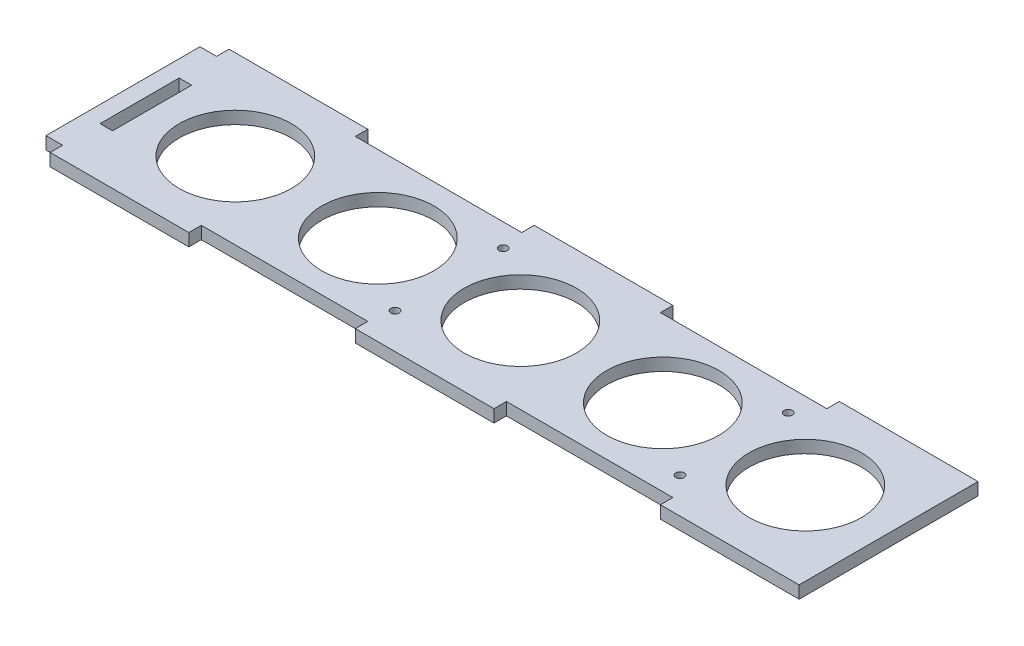
ISO-10303-21;
HEADER;
FILE_DESCRIPTION(('STEP AP214'),'2;1');
FILE_NAME('part.step','',(''),(''),'','','');
FILE_SCHEMA(('AUTOMOTIVE_DESIGN { 1 0 10303 214 1 1 1 1 }'));
ENDSEC;
DATA;
#1=APPLICATION_CONTEXT('core data for automotive mechanical design processes');
#2=APPLICATION_PROTOCOL_DEFINITION('international standard','automotive_design',2000,#1);
#3=PRODUCT_CONTEXT('',#1,'mechanical');
#4=PRODUCT('Part','Part','',(#3));
#5=PRODUCT_RELATED_PRODUCT_CATEGORY('part','',(#4));
#6=PRODUCT_DEFINITION_FORMATION('','',#4);
#7=PRODUCT_DEFINITION_CONTEXT('part definition',#1,'design');
#8=PRODUCT_DEFINITION('design','',#6,#7);
#9=PRODUCT_DEFINITION_SHAPE('','',#8);
#10=(LENGTH_UNIT() NAMED_UNIT(*) SI_UNIT(.MILLI.,.METRE.));
#11=(NAMED_UNIT(*) PLANE_ANGLE_UNIT() SI_UNIT($,.RADIAN.));
#12=(NAMED_UNIT(*) SI_UNIT($,.STERADIAN.) SOLID_ANGLE_UNIT());
#13=UNCERTAINTY_MEASURE_WITH_UNIT(LENGTH_MEASURE(1.E-05),#10,'distance_accuracy_value','');
#14=(GEOMETRIC_REPRESENTATION_CONTEXT(3) GLOBAL_UNCERTAINTY_ASSIGNED_CONTEXT((#13)) GLOBAL_UNIT_ASSIGNED_CONTEXT((#10,
#11,#12)) REPRESENTATION_CONTEXT('',''));
#15=CARTESIAN_POINT('',(0.,0.,0.));
#16=DIRECTION('',(0.,0.,1.));
#17=DIRECTION('',(1.,0.,0.));
#18=AXIS2_PLACEMENT_3D('',#15,#16,#17);
#19=CARTESIAN_POINT('',(74.375,3.,13.));
#20=DIRECTION('',(0.,-1.,0.));
#21=DIRECTION('',(0.,0.,-1.));
#22=AXIS2_PLACEMENT_3D('',#19,#20,#21);
#23=CYLINDRICAL_SURFACE('',#22,0.999999999999998);
#24=CARTESIAN_POINT('',(74.375,3.,13.));
#25=DIRECTION('',(0.,1.,0.));
#26=DIRECTION('',(0.,0.,1.));
#27=AXIS2_PLACEMENT_3D('',#24,#25,#26);
#28=CIRCLE('',#27,0.999999999999998);
#29=CARTESIAN_POINT('',(74.375,3.,14.));
#30=VERTEX_POINT('',#29);
#31=EDGE_CURVE('E387',#30,#30,#28,.F.);
#32=ORIENTED_EDGE('',*,*,#31,.F.);
#33=EDGE_LOOP('',(#32));
#34=FACE_BOUND('',#33,.T.);
#35=CARTESIAN_POINT('',(74.375,0.,13.));
#36=DIRECTION('',(0.,1.,0.));
#37=DIRECTION('',(0.,0.,1.));
#38=AXIS2_PLACEMENT_3D('',#35,#36,#37);
#39=CIRCLE('',#38,0.999999999999998);
#40=CARTESIAN_POINT('',(74.375,0.,14.));
#41=VERTEX_POINT('',#40);
#42=EDGE_CURVE('E260',#41,#41,#39,.F.);
#43=ORIENTED_EDGE('',*,*,#42,.T.);
#44=EDGE_LOOP('',(#43));
#45=FACE_BOUND('',#44,.T.);
#46=ADVANCED_FACE('F41',(#34,#45),#23,.F.);
#47=CARTESIAN_POINT('',(33.3333333333333,3.,0.));
#48=DIRECTION('',(-1.,0.,0.));
#49=DIRECTION('',(0.,0.,1.));
#50=AXIS2_PLACEMENT_3D('',#47,#48,#49);
#51=PLANE('',#50);
#52=DIRECTION('',(0.,0.,-1.));
#53=VECTOR('',#52,1.);
#54=CARTESIAN_POINT('',(33.3333333333333,0.,0.));
#55=LINE('',#54,#53);
#56=CARTESIAN_POINT('',(33.3333333333333,0.,21.5));
#57=VERTEX_POINT('',#56);
#58=CARTESIAN_POINT('',(33.3333333333333,0.,18.5));
#59=VERTEX_POINT('',#58);
#60=EDGE_CURVE('E174',#57,#59,#55,.T.);
#61=ORIENTED_EDGE('',*,*,#60,.T.);
#62=DIRECTION('',(0.,-1.,0.));
#63=VECTOR('',#62,1.);
#64=CARTESIAN_POINT('',(33.3333333333333,3.,18.5));
#65=LINE('',#64,#63);
#66=CARTESIAN_POINT('',(33.3333333333333,3.,18.5));
#67=VERTEX_POINT('',#66);
#68=EDGE_CURVE('E477',#67,#59,#65,.T.);
#69=ORIENTED_EDGE('',*,*,#68,.F.);
#70=DIRECTION('',(0.,0.,-1.));
#71=VECTOR('',#70,1.);
#72=CARTESIAN_POINT('',(33.3333333333333,3.,0.));
#73=LINE('',#72,#71);
#74=CARTESIAN_POINT('',(33.3333333333333,3.,21.5));
#75=VERTEX_POINT('',#74);
#76=EDGE_CURVE('E299',#75,#67,#73,.T.);
#77=ORIENTED_EDGE('',*,*,#76,.F.);
#78=DIRECTION('',(0.,-1.,0.));
#79=VECTOR('',#78,1.);
#80=CARTESIAN_POINT('',(33.3333333333333,3.,21.5));
#81=LINE('',#80,#79);
#82=EDGE_CURVE('E481',#75,#57,#81,.T.);
#83=ORIENTED_EDGE('',*,*,#82,.T.);
#84=EDGE_LOOP('',(#61,#69,#77,#83));
#85=FACE_BOUND('',#84,.T.);
#86=ADVANCED_FACE('F609',(#85),#51,.F.);
#87=CARTESIAN_POINT('',(0.,3.,18.5));
#88=DIRECTION('',(0.,0.,-1.));
#89=DIRECTION('',(-1.,0.,0.));
#90=AXIS2_PLACEMENT_3D('',#87,#88,#89);
#91=PLANE('',#90);
#92=DIRECTION('',(1.,0.,0.));
#93=VECTOR('',#92,1.);
#94=CARTESIAN_POINT('',(0.,0.,18.5));
#95=LINE('',#94,#93);
#96=CARTESIAN_POINT('',(73.3333333333333,0.,18.5));
#97=VERTEX_POINT('',#96);
#98=EDGE_CURVE('E180',#59,#97,#95,.T.);
#99=ORIENTED_EDGE('',*,*,#98,.T.);
#100=DIRECTION('',(0.,-1.,0.));
#101=VECTOR('',#100,1.);
#102=CARTESIAN_POINT('',(73.3333333333333,3.,18.5));
#103=LINE('',#102,#101);
#104=CARTESIAN_POINT('',(73.3333333333333,3.,18.5));
#105=VERTEX_POINT('',#104);
#106=EDGE_CURVE('E473',#105,#97,#103,.T.);
#107=ORIENTED_EDGE('',*,*,#106,.F.);
#108=DIRECTION('',(1.,0.,0.));
#109=VECTOR('',#108,1.);
#110=CARTESIAN_POINT('',(0.,3.,18.5));
#111=LINE('',#110,#109);
#112=EDGE_CURVE('E305',#67,#105,#111,.T.);
#113=ORIENTED_EDGE('',*,*,#112,.F.);
#114=ORIENTED_EDGE('',*,*,#68,.T.);
#115=EDGE_LOOP('',(#99,#107,#113,#114));
#116=FACE_BOUND('',#115,.T.);
#117=ADVANCED_FACE('F688',(#116),#91,.F.);
#118=CARTESIAN_POINT('',(73.3333333333333,3.,0.));
#119=DIRECTION('',(-1.,0.,0.));
#120=DIRECTION('',(0.,0.,1.));
#121=AXIS2_PLACEMENT_3D('',#118,#119,#120);
#122=PLANE('',#121);
#123=DIRECTION('',(0.,0.,-1.));
#124=VECTOR('',#123,1.);
#125=CARTESIAN_POINT('',(73.3333333333333,0.,0.));
#126=LINE('',#125,#124);
#127=CARTESIAN_POINT('',(73.3333333333333,0.,21.5));
#128=VERTEX_POINT('',#127);
#129=EDGE_CURVE('E184',#128,#97,#126,.T.);
#130=ORIENTED_EDGE('',*,*,#129,.F.);
#131=DIRECTION('',(0.,-1.,0.));
#132=VECTOR('',#131,1.);
#133=CARTESIAN_POINT('',(73.3333333333333,3.,21.5));
#134=LINE('',#133,#132);
#135=CARTESIAN_POINT('',(73.3333333333333,3.,21.5));
#136=VERTEX_POINT('',#135);
#137=EDGE_CURVE('E469',#136,#128,#134,.T.);
#138=ORIENTED_EDGE('',*,*,#137,.F.);
#139=DIRECTION('',(0.,0.,-1.));
#140=VECTOR('',#139,1.);
#141=CARTESIAN_POINT('',(73.3333333333333,3.,0.));
#142=LINE('',#141,#140);
#143=EDGE_CURVE('E309',#136,#105,#142,.T.);
#144=ORIENTED_EDGE('',*,*,#143,.T.);
#145=ORIENTED_EDGE('',*,*,#106,.T.);
#146=EDGE_LOOP('',(#130,#138,#144,#145));
#147=FACE_BOUND('',#146,.T.);
#148=ADVANCED_FACE('F685',(#147),#122,.T.);
#149=CARTESIAN_POINT('',(0.,3.,21.5));
#150=DIRECTION('',(0.,0.,-1.));
#151=DIRECTION('',(-1.,0.,0.));
#152=AXIS2_PLACEMENT_3D('',#149,#150,#151);
#153=PLANE('',#152);
#154=DIRECTION('',(1.,0.,0.));
#155=VECTOR('',#154,1.);
#156=CARTESIAN_POINT('',(0.,0.,21.5));
#157=LINE('',#156,#155);
#158=CARTESIAN_POINT('',(106.666666666667,0.,21.4999999999999));
#159=VERTEX_POINT('',#158);
#160=EDGE_CURVE('E177',#128,#159,#157,.T.);
#161=ORIENTED_EDGE('',*,*,#160,.T.);
#162=DIRECTION('',(0.,-1.,0.));
#163=VECTOR('',#162,1.);
#164=CARTESIAN_POINT('',(106.666666666667,3.,21.4999999999999));
#165=LINE('',#164,#163);
#166=CARTESIAN_POINT('',(106.666666666667,3.,21.4999999999999));
#167=VERTEX_POINT('',#166);
#168=EDGE_CURVE('E465',#167,#159,#165,.T.);
#169=ORIENTED_EDGE('',*,*,#168,.F.);
#170=DIRECTION('',(1.,0.,0.));
#171=VECTOR('',#170,1.);
#172=CARTESIAN_POINT('',(0.,3.,21.5));
#173=LINE('',#172,#171);
#174=EDGE_CURVE('E302',#136,#167,#173,.T.);
#175=ORIENTED_EDGE('',*,*,#174,.F.);
#176=ORIENTED_EDGE('',*,*,#137,.T.);
#177=EDGE_LOOP('',(#161,#169,#175,#176));
#178=FACE_BOUND('',#177,.T.);
#179=ADVANCED_FACE('F682',(#178),#153,.F.);
#180=CARTESIAN_POINT('',(106.666666666667,3.,0.));
#181=DIRECTION('',(-1.,0.,0.));
#182=DIRECTION('',(0.,0.,1.));
#183=AXIS2_PLACEMENT_3D('',#180,#181,#182);
#184=PLANE('',#183);
#185=DIRECTION('',(0.,0.,-1.));
#186=VECTOR('',#185,1.);
#187=CARTESIAN_POINT('',(106.666666666667,0.,0.));
#188=LINE('',#187,#186);
#189=CARTESIAN_POINT('',(106.666666666667,0.,18.5));
#190=VERTEX_POINT('',#189);
#191=EDGE_CURVE('E191',#159,#190,#188,.T.);
#192=ORIENTED_EDGE('',*,*,#191,.T.);
#193=DIRECTION('',(0.,-1.,0.));
#194=VECTOR('',#193,1.);
#195=CARTESIAN_POINT('',(106.666666666667,3.,18.5));
#196=LINE('',#195,#194);
#197=CARTESIAN_POINT('',(106.666666666667,3.,18.5));
#198=VERTEX_POINT('',#197);
#199=EDGE_CURVE('E461',#198,#190,#196,.T.);
#200=ORIENTED_EDGE('',*,*,#199,.F.);
#201=DIRECTION('',(0.,0.,-1.));
#202=VECTOR('',#201,1.);
#203=CARTESIAN_POINT('',(106.666666666667,3.,0.));
#204=LINE('',#203,#202);
#205=EDGE_CURVE('E316',#167,#198,#204,.T.);
#206=ORIENTED_EDGE('',*,*,#205,.F.);
#207=ORIENTED_EDGE('',*,*,#168,.T.);
#208=EDGE_LOOP('',(#192,#200,#206,#207));
#209=FACE_BOUND('',#208,.T.);
#210=ADVANCED_FACE('F677',(#209),#184,.F.);
#211=CARTESIAN_POINT('',(0.,3.,18.5));
#212=DIRECTION('',(0.,0.,-1.));
#213=DIRECTION('',(-1.,0.,0.));
#214=AXIS2_PLACEMENT_3D('',#211,#212,#213);
#215=PLANE('',#214);
#216=DIRECTION('',(1.,0.,0.));
#217=VECTOR('',#216,1.);
#218=CARTESIAN_POINT('',(0.,0.,18.5));
#219=LINE('',#218,#217);
#220=CARTESIAN_POINT('',(146.666666666667,0.,18.5));
#221=VERTEX_POINT('',#220);
#222=EDGE_CURVE('E194',#190,#221,#219,.T.);
#223=ORIENTED_EDGE('',*,*,#222,.T.);
#224=DIRECTION('',(0.,-1.,0.));
#225=VECTOR('',#224,1.);
#226=CARTESIAN_POINT('',(146.666666666667,3.,18.5));
#227=LINE('',#226,#225);
#228=CARTESIAN_POINT('',(146.666666666667,3.,18.5));
#229=VERTEX_POINT('',#228);
#230=EDGE_CURVE('E457',#229,#221,#227,.T.);
#231=ORIENTED_EDGE('',*,*,#230,.F.);
#232=DIRECTION('',(1.,0.,0.));
#233=VECTOR('',#232,1.);
#234=CARTESIAN_POINT('',(0.,3.,18.5));
#235=LINE('',#234,#233);
#236=EDGE_CURVE('E319',#198,#229,#235,.T.);
#237=ORIENTED_EDGE('',*,*,#236,.F.);
#238=ORIENTED_EDGE('',*,*,#199,.T.);
#239=EDGE_LOOP('',(#223,#231,#237,#238));
#240=FACE_BOUND('',#239,.T.);
#241=ADVANCED_FACE('F671',(#240),#215,.F.);
#242=CARTESIAN_POINT('',(146.666666666667,3.,0.));
#243=DIRECTION('',(-1.,0.,0.));
#244=DIRECTION('',(0.,0.,1.));
#245=AXIS2_PLACEMENT_3D('',#242,#243,#244);
#246=PLANE('',#245);
#247=DIRECTION('',(0.,0.,-1.));
#248=VECTOR('',#247,1.);
#249=CARTESIAN_POINT('',(146.666666666667,0.,0.));
#250=LINE('',#249,#248);
#251=CARTESIAN_POINT('',(146.666666666667,0.,21.4999999999999));
#252=VERTEX_POINT('',#251);
#253=EDGE_CURVE('E198',#252,#221,#250,.T.);
#254=ORIENTED_EDGE('',*,*,#253,.F.);
#255=DIRECTION('',(0.,-1.,0.));
#256=VECTOR('',#255,1.);
#257=CARTESIAN_POINT('',(146.666666666667,3.,21.4999999999999));
#258=LINE('',#257,#256);
#259=CARTESIAN_POINT('',(146.666666666667,3.,21.4999999999999));
#260=VERTEX_POINT('',#259);
#261=EDGE_CURVE('E453',#260,#252,#258,.T.);
#262=ORIENTED_EDGE('',*,*,#261,.F.);
#263=DIRECTION('',(0.,0.,-1.));
#264=VECTOR('',#263,1.);
#265=CARTESIAN_POINT('',(146.666666666667,3.,0.));
#266=LINE('',#265,#264);
#267=EDGE_CURVE('E323',#260,#229,#266,.T.);
#268=ORIENTED_EDGE('',*,*,#267,.T.);
#269=ORIENTED_EDGE('',*,*,#230,.T.);
#270=EDGE_LOOP('',(#254,#262,#268,#269));
#271=FACE_BOUND('',#270,.T.);
#272=ADVANCED_FACE('F665',(#271),#246,.T.);
#273=CARTESIAN_POINT('',(180.,0.,21.4999999999999));
#274=VERTEX_POINT('',#273);
#275=EDGE_CURVE('E176',#252,#274,#157,.T.);
#276=ORIENTED_EDGE('',*,*,#275,.T.);
#277=DIRECTION('',(0.,-1.,0.));
#278=VECTOR('',#277,1.);
#279=CARTESIAN_POINT('',(180.,3.,21.4999999999999));
#280=LINE('',#279,#278);
#281=CARTESIAN_POINT('',(180.,3.,21.4999999999999));
#282=VERTEX_POINT('',#281);
#283=EDGE_CURVE('E449',#282,#274,#280,.T.);
#284=ORIENTED_EDGE('',*,*,#283,.F.);
#285=EDGE_CURVE('E301',#260,#282,#173,.T.);
#286=ORIENTED_EDGE('',*,*,#285,.F.);
#287=ORIENTED_EDGE('',*,*,#261,.T.);
#288=EDGE_LOOP('',(#276,#284,#286,#287));
#289=FACE_BOUND('',#288,.T.);
#290=ADVANCED_FACE('F689',(#289),#153,.F.);
#291=CARTESIAN_POINT('',(180.,3.,0.));
#292=DIRECTION('',(1.,0.,0.));
#293=DIRECTION('',(0.,0.,-1.));
#294=AXIS2_PLACEMENT_3D('',#291,#292,#293);
#295=PLANE('',#294);
#296=DIRECTION('',(0.,0.,1.));
#297=VECTOR('',#296,1.);
#298=CARTESIAN_POINT('',(180.,0.,0.));
#299=LINE('',#298,#297);
#300=CARTESIAN_POINT('',(180.,0.,-21.5));
#301=VERTEX_POINT('',#300);
#302=EDGE_CURVE('E205',#301,#274,#299,.T.);
#303=ORIENTED_EDGE('',*,*,#302,.F.);
#304=DIRECTION('',(0.,-1.,0.));
#305=VECTOR('',#304,1.);
#306=CARTESIAN_POINT('',(180.,3.,-21.5));
#307=LINE('',#306,#305);
#308=CARTESIAN_POINT('',(180.,3.,-21.5));
#309=VERTEX_POINT('',#308);
#310=EDGE_CURVE('E445',#309,#301,#307,.T.);
#311=ORIENTED_EDGE('',*,*,#310,.F.);
#312=DIRECTION('',(0.,0.,1.));
#313=VECTOR('',#312,1.);
#314=CARTESIAN_POINT('',(180.,3.,0.));
#315=LINE('',#314,#313);
#316=EDGE_CURVE('E330',#309,#282,#315,.T.);
#317=ORIENTED_EDGE('',*,*,#316,.T.);
#318=ORIENTED_EDGE('',*,*,#283,.T.);
#319=EDGE_LOOP('',(#303,#311,#317,#318));
#320=FACE_BOUND('',#319,.T.);
#321=ADVANCED_FACE('F658',(#320),#295,.T.);
#322=CARTESIAN_POINT('',(0.,3.,-21.5));
#323=DIRECTION('',(0.,0.,-1.));
#324=DIRECTION('',(-1.,0.,0.));
#325=AXIS2_PLACEMENT_3D('',#322,#323,#324);
#326=PLANE('',#325);
#327=DIRECTION('',(1.,0.,0.));
#328=VECTOR('',#327,1.);
#329=CARTESIAN_POINT('',(0.,0.,-21.5));
#330=LINE('',#329,#328);
#331=CARTESIAN_POINT('',(146.666666666667,0.,-21.5));
#332=VERTEX_POINT('',#331);
#333=EDGE_CURVE('E208',#332,#301,#330,.T.);
#334=ORIENTED_EDGE('',*,*,#333,.F.);
#335=DIRECTION('',(0.,-1.,0.));
#336=VECTOR('',#335,1.);
#337=CARTESIAN_POINT('',(146.666666666667,3.,-21.5));
#338=LINE('',#337,#336);
#339=CARTESIAN_POINT('',(146.666666666667,3.,-21.5));
#340=VERTEX_POINT('',#339);
#341=EDGE_CURVE('E441',#340,#332,#338,.T.);
#342=ORIENTED_EDGE('',*,*,#341,.F.);
#343=DIRECTION('',(1.,0.,0.));
#344=VECTOR('',#343,1.);
#345=CARTESIAN_POINT('',(0.,3.,-21.5));
#346=LINE('',#345,#344);
#347=EDGE_CURVE('E333',#340,#309,#346,.T.);
#348=ORIENTED_EDGE('',*,*,#347,.T.);
#349=ORIENTED_EDGE('',*,*,#310,.T.);
#350=EDGE_LOOP('',(#334,#342,#348,#349));
#351=FACE_BOUND('',#350,.T.);
#352=ADVANCED_FACE('F653',(#351),#326,.T.);
#353=CARTESIAN_POINT('',(146.666666666667,3.,0.));
#354=DIRECTION('',(1.,0.,0.));
#355=DIRECTION('',(0.,0.,-1.));
#356=AXIS2_PLACEMENT_3D('',#353,#354,#355);
#357=PLANE('',#356);
#358=DIRECTION('',(0.,0.,1.));
#359=VECTOR('',#358,1.);
#360=CARTESIAN_POINT('',(146.666666666667,0.,0.));
#361=LINE('',#360,#359);
#362=CARTESIAN_POINT('',(146.666666666667,0.,-18.5));
#363=VERTEX_POINT('',#362);
#364=EDGE_CURVE('E212',#332,#363,#361,.T.);
#365=ORIENTED_EDGE('',*,*,#364,.T.);
#366=DIRECTION('',(0.,-1.,0.));
#367=VECTOR('',#366,1.);
#368=CARTESIAN_POINT('',(146.666666666667,3.,-18.5));
#369=LINE('',#368,#367);
#370=CARTESIAN_POINT('',(146.666666666667,3.,-18.5));
#371=VERTEX_POINT('',#370);
#372=EDGE_CURVE('E437',#371,#363,#369,.T.);
#373=ORIENTED_EDGE('',*,*,#372,.F.);
#374=DIRECTION('',(0.,0.,1.));
#375=VECTOR('',#374,1.);
#376=CARTESIAN_POINT('',(146.666666666667,3.,0.));
#377=LINE('',#376,#375);
#378=EDGE_CURVE('E337',#340,#371,#377,.T.);
#379=ORIENTED_EDGE('',*,*,#378,.F.);
#380=ORIENTED_EDGE('',*,*,#341,.T.);
#381=EDGE_LOOP('',(#365,#373,#379,#380));
#382=FACE_BOUND('',#381,.T.);
#383=ADVANCED_FACE('F650',(#382),#357,.F.);
#384=CARTESIAN_POINT('',(0.,3.,-18.5));
#385=DIRECTION('',(0.,0.,-1.));
#386=DIRECTION('',(-1.,0.,0.));
#387=AXIS2_PLACEMENT_3D('',#384,#385,#386);
#388=PLANE('',#387);
#389=DIRECTION('',(1.,0.,0.));
#390=VECTOR('',#389,1.);
#391=CARTESIAN_POINT('',(0.,0.,-18.5));
#392=LINE('',#391,#390);
#393=CARTESIAN_POINT('',(106.666666666667,0.,-18.5));
#394=VERTEX_POINT('',#393);
#395=EDGE_CURVE('E218',#394,#363,#392,.T.);
#396=ORIENTED_EDGE('',*,*,#395,.F.);
#397=DIRECTION('',(0.,-1.,0.));
#398=VECTOR('',#397,1.);
#399=CARTESIAN_POINT('',(106.666666666667,3.,-18.5));
#400=LINE('',#399,#398);
#401=CARTESIAN_POINT('',(106.666666666667,3.,-18.5));
#402=VERTEX_POINT('',#401);
#403=EDGE_CURVE('E433',#402,#394,#400,.T.);
#404=ORIENTED_EDGE('',*,*,#403,.F.);
#405=DIRECTION('',(1.,0.,0.));
#406=VECTOR('',#405,1.);
#407=CARTESIAN_POINT('',(0.,3.,-18.5));
#408=LINE('',#407,#406);
#409=EDGE_CURVE('E343',#402,#371,#408,.T.);
#410=ORIENTED_EDGE('',*,*,#409,.T.);
#411=ORIENTED_EDGE('',*,*,#372,.T.);
#412=EDGE_LOOP('',(#396,#404,#410,#411));
#413=FACE_BOUND('',#412,.T.);
#414=ADVANCED_FACE('F646',(#413),#388,.T.);
#415=CARTESIAN_POINT('',(106.666666666667,3.,0.));
#416=DIRECTION('',(1.,0.,0.));
#417=DIRECTION('',(0.,0.,-1.));
#418=AXIS2_PLACEMENT_3D('',#415,#416,#417);
#419=PLANE('',#418);
#420=DIRECTION('',(0.,0.,1.));
#421=VECTOR('',#420,1.);
#422=CARTESIAN_POINT('',(106.666666666667,0.,0.));
#423=LINE('',#422,#421);
#424=CARTESIAN_POINT('',(106.666666666667,0.,-21.5));
#425=VERTEX_POINT('',#424);
#426=EDGE_CURVE('E222',#425,#394,#423,.T.);
#427=ORIENTED_EDGE('',*,*,#426,.F.);
#428=DIRECTION('',(0.,-1.,0.));
#429=VECTOR('',#428,1.);
#430=CARTESIAN_POINT('',(106.666666666667,3.,-21.5));
#431=LINE('',#430,#429);
#432=CARTESIAN_POINT('',(106.666666666667,3.,-21.5));
#433=VERTEX_POINT('',#432);
#434=EDGE_CURVE('E429',#433,#425,#431,.T.);
#435=ORIENTED_EDGE('',*,*,#434,.F.);
#436=DIRECTION('',(0.,0.,1.));
#437=VECTOR('',#436,1.);
#438=CARTESIAN_POINT('',(106.666666666667,3.,0.));
#439=LINE('',#438,#437);
#440=EDGE_CURVE('E347',#433,#402,#439,.T.);
#441=ORIENTED_EDGE('',*,*,#440,.T.);
#442=ORIENTED_EDGE('',*,*,#403,.T.);
#443=EDGE_LOOP('',(#427,#435,#441,#442));
#444=FACE_BOUND('',#443,.T.);
#445=ADVANCED_FACE('F642',(#444),#419,.T.);
#446=CARTESIAN_POINT('',(73.3333333333333,0.,-21.5));
#447=VERTEX_POINT('',#446);
#448=EDGE_CURVE('E215',#447,#425,#330,.T.);
#449=ORIENTED_EDGE('',*,*,#448,.F.);
#450=DIRECTION('',(0.,-1.,0.));
#451=VECTOR('',#450,1.);
#452=CARTESIAN_POINT('',(73.3333333333333,3.,-21.5));
#453=LINE('',#452,#451);
#454=CARTESIAN_POINT('',(73.3333333333333,3.,-21.5));
#455=VERTEX_POINT('',#454);
#456=EDGE_CURVE('E425',#455,#447,#453,.T.);
#457=ORIENTED_EDGE('',*,*,#456,.F.);
#458=EDGE_CURVE('E340',#455,#433,#346,.T.);
#459=ORIENTED_EDGE('',*,*,#458,.T.);
#460=ORIENTED_EDGE('',*,*,#434,.T.);
#461=EDGE_LOOP('',(#449,#457,#459,#460));
#462=FACE_BOUND('',#461,.T.);
#463=ADVANCED_FACE('F637',(#462),#326,.T.);
#464=CARTESIAN_POINT('',(73.3333333333333,3.,0.));
#465=DIRECTION('',(1.,0.,0.));
#466=DIRECTION('',(0.,0.,-1.));
#467=AXIS2_PLACEMENT_3D('',#464,#465,#466);
#468=PLANE('',#467);
#469=DIRECTION('',(0.,0.,1.));
#470=VECTOR('',#469,1.);
#471=CARTESIAN_POINT('',(73.3333333333333,0.,0.));
#472=LINE('',#471,#470);
#473=CARTESIAN_POINT('',(73.3333333333333,0.,-18.5));
#474=VERTEX_POINT('',#473);
#475=EDGE_CURVE('E229',#447,#474,#472,.T.);
#476=ORIENTED_EDGE('',*,*,#475,.T.);
#477=DIRECTION('',(0.,-1.,0.));
#478=VECTOR('',#477,1.);
#479=CARTESIAN_POINT('',(73.3333333333333,3.,-18.5));
#480=LINE('',#479,#478);
#481=CARTESIAN_POINT('',(73.3333333333333,3.,-18.5));
#482=VERTEX_POINT('',#481);
#483=EDGE_CURVE('E421',#482,#474,#480,.T.);
#484=ORIENTED_EDGE('',*,*,#483,.F.);
#485=DIRECTION('',(0.,0.,1.));
#486=VECTOR('',#485,1.);
#487=CARTESIAN_POINT('',(73.3333333333333,3.,0.));
#488=LINE('',#487,#486);
#489=EDGE_CURVE('E354',#455,#482,#488,.T.);
#490=ORIENTED_EDGE('',*,*,#489,.F.);
#491=ORIENTED_EDGE('',*,*,#456,.T.);
#492=EDGE_LOOP('',(#476,#484,#490,#491));
#493=FACE_BOUND('',#492,.T.);
#494=ADVANCED_FACE('F634',(#493),#468,.F.);
#495=CARTESIAN_POINT('',(0.,3.,-18.5));
#496=DIRECTION('',(0.,0.,-1.));
#497=DIRECTION('',(-1.,0.,0.));
#498=AXIS2_PLACEMENT_3D('',#495,#496,#497);
#499=PLANE('',#498);
#500=DIRECTION('',(1.,0.,0.));
#501=VECTOR('',#500,1.);
#502=CARTESIAN_POINT('',(0.,0.,-18.5));
#503=LINE('',#502,#501);
#504=CARTESIAN_POINT('',(33.3333333333333,0.,-18.5));
#505=VERTEX_POINT('',#504);
#506=EDGE_CURVE('E232',#505,#474,#503,.T.);
#507=ORIENTED_EDGE('',*,*,#506,.F.);
#508=DIRECTION('',(0.,-1.,0.));
#509=VECTOR('',#508,1.);
#510=CARTESIAN_POINT('',(33.3333333333333,3.,-18.5));
#511=LINE('',#510,#509);
#512=CARTESIAN_POINT('',(33.3333333333333,3.,-18.5));
#513=VERTEX_POINT('',#512);
#514=EDGE_CURVE('E417',#513,#505,#511,.T.);
#515=ORIENTED_EDGE('',*,*,#514,.F.);
#516=DIRECTION('',(1.,0.,0.));
#517=VECTOR('',#516,1.);
#518=CARTESIAN_POINT('',(0.,3.,-18.5));
#519=LINE('',#518,#517);
#520=EDGE_CURVE('E357',#513,#482,#519,.T.);
#521=ORIENTED_EDGE('',*,*,#520,.T.);
#522=ORIENTED_EDGE('',*,*,#483,.T.);
#523=EDGE_LOOP('',(#507,#515,#521,#522));
#524=FACE_BOUND('',#523,.T.);
#525=ADVANCED_FACE('F629',(#524),#499,.T.);
#526=CARTESIAN_POINT('',(33.3333333333333,3.,0.));
#527=DIRECTION('',(1.,0.,0.));
#528=DIRECTION('',(0.,0.,-1.));
#529=AXIS2_PLACEMENT_3D('',#526,#527,#528);
#530=PLANE('',#529);
#531=DIRECTION('',(0.,0.,1.));
#532=VECTOR('',#531,1.);
#533=CARTESIAN_POINT('',(33.3333333333333,0.,0.));
#534=LINE('',#533,#532);
#535=CARTESIAN_POINT('',(33.3333333333333,0.,-21.5));
#536=VERTEX_POINT('',#535);
#537=EDGE_CURVE('E236',#536,#505,#534,.T.);
#538=ORIENTED_EDGE('',*,*,#537,.F.);
#539=DIRECTION('',(0.,-1.,0.));
#540=VECTOR('',#539,1.);
#541=CARTESIAN_POINT('',(33.3333333333333,3.,-21.5));
#542=LINE('',#541,#540);
#543=CARTESIAN_POINT('',(33.3333333333333,3.,-21.5));
#544=VERTEX_POINT('',#543);
#545=EDGE_CURVE('E413',#544,#536,#542,.T.);
#546=ORIENTED_EDGE('',*,*,#545,.F.);
#547=DIRECTION('',(0.,0.,1.));
#548=VECTOR('',#547,1.);
#549=CARTESIAN_POINT('',(33.3333333333333,3.,0.));
#550=LINE('',#549,#548);
#551=EDGE_CURVE('E361',#544,#513,#550,.T.);
#552=ORIENTED_EDGE('',*,*,#551,.T.);
#553=ORIENTED_EDGE('',*,*,#514,.T.);
#554=EDGE_LOOP('',(#538,#546,#552,#553));
#555=FACE_BOUND('',#554,.T.);
#556=ADVANCED_FACE('F624',(#555),#530,.T.);
#557=CARTESIAN_POINT('',(0.,0.,-21.5));
#558=VERTEX_POINT('',#557);
#559=EDGE_CURVE('E214',#558,#536,#330,.T.);
#560=ORIENTED_EDGE('',*,*,#559,.F.);
#561=DIRECTION('',(0.,-1.,0.));
#562=VECTOR('',#561,1.);
#563=CARTESIAN_POINT('',(0.,3.,-21.5));
#564=LINE('',#563,#562);
#565=CARTESIAN_POINT('',(0.,3.,-21.5));
#566=VERTEX_POINT('',#565);
#567=EDGE_CURVE('E409',#566,#558,#564,.T.);
#568=ORIENTED_EDGE('',*,*,#567,.F.);
#569=EDGE_CURVE('E339',#566,#544,#346,.T.);
#570=ORIENTED_EDGE('',*,*,#569,.T.);
#571=ORIENTED_EDGE('',*,*,#545,.T.);
#572=EDGE_LOOP('',(#560,#568,#570,#571));
#573=FACE_BOUND('',#572,.T.);
#574=ADVANCED_FACE('F621',(#573),#326,.T.);
#575=CARTESIAN_POINT('',(0.,3.,0.));
#576=DIRECTION('',(1.,0.,0.));
#577=DIRECTION('',(0.,0.,-1.));
#578=AXIS2_PLACEMENT_3D('',#575,#576,#577);
#579=PLANE('',#578);
#580=DIRECTION('',(0.,-1.,0.));
#581=VECTOR('',#580,1.);
#582=CARTESIAN_POINT('',(0.,3.,-18.5));
#583=LINE('',#582,#581);
#584=CARTESIAN_POINT('',(0.,3.,-18.5));
#585=VERTEX_POINT('',#584);
#586=CARTESIAN_POINT('',(0.,0.,-18.5));
#587=VERTEX_POINT('',#586);
#588=EDGE_CURVE('E11',#585,#587,#583,.T.);
#589=ORIENTED_EDGE('',*,*,#588,.F.);
#590=DIRECTION('',(0.,0.,1.));
#591=VECTOR('',#590,1.);
#592=CARTESIAN_POINT('',(0.,3.,0.));
#593=LINE('',#592,#591);
#594=EDGE_CURVE('E368',#566,#585,#593,.T.);
#595=ORIENTED_EDGE('',*,*,#594,.F.);
#596=ORIENTED_EDGE('',*,*,#567,.T.);
#597=DIRECTION('',(0.,0.,1.));
#598=VECTOR('',#597,1.);
#599=CARTESIAN_POINT('',(0.,0.,0.));
#600=LINE('',#599,#598);
#601=EDGE_CURVE('E243',#558,#587,#600,.T.);
#602=ORIENTED_EDGE('',*,*,#601,.T.);
#603=EDGE_LOOP('',(#589,#595,#596,#602));
#604=FACE_BOUND('',#603,.T.);
#605=ADVANCED_FACE('F618',(#604),#579,.F.);
#606=CARTESIAN_POINT('',(0.,3.,-9.5));
#607=DIRECTION('',(0.,0.,-1.));
#608=DIRECTION('',(-1.,0.,0.));
#609=AXIS2_PLACEMENT_3D('',#606,#607,#608);
#610=PLANE('',#609);
#611=DIRECTION('',(1.,0.,0.));
#612=VECTOR('',#611,1.);
#613=CARTESIAN_POINT('',(0.,0.,-9.5));
#614=LINE('',#613,#612);
#615=CARTESIAN_POINT('',(0.,0.,-9.5));
#616=VERTEX_POINT('',#615);
#617=CARTESIAN_POINT('',(3.,0.,-9.5));
#618=VERTEX_POINT('',#617);
#619=EDGE_CURVE('E245',#616,#618,#614,.T.);
#620=ORIENTED_EDGE('',*,*,#619,.T.);
#621=DIRECTION('',(0.,-1.,0.));
#622=VECTOR('',#621,1.);
#623=CARTESIAN_POINT('',(3.,3.,-9.5));
#624=LINE('',#623,#622);
#625=CARTESIAN_POINT('',(3.,3.,-9.5));
#626=VERTEX_POINT('',#625);
#627=EDGE_CURVE('E401',#626,#618,#624,.T.);
#628=ORIENTED_EDGE('',*,*,#627,.F.);
#629=DIRECTION('',(1.,0.,0.));
#630=VECTOR('',#629,1.);
#631=CARTESIAN_POINT('',(0.,3.,-9.5));
#632=LINE('',#631,#630);
#633=CARTESIAN_POINT('',(0.,3.,-9.5));
#634=VERTEX_POINT('',#633);
#635=EDGE_CURVE('E371',#634,#626,#632,.T.);
#636=ORIENTED_EDGE('',*,*,#635,.F.);
#637=DIRECTION('',(0.,-1.,0.));
#638=VECTOR('',#637,1.);
#639=CARTESIAN_POINT('',(0.,3.,-9.5));
#640=LINE('',#639,#638);
#641=EDGE_CURVE('E405',#634,#616,#640,.T.);
#642=ORIENTED_EDGE('',*,*,#641,.T.);
#643=EDGE_LOOP('',(#620,#628,#636,#642));
#644=FACE_BOUND('',#643,.T.);
#645=ADVANCED_FACE('F735',(#644),#610,.F.);
#646=CARTESIAN_POINT('',(3.,3.,0.));
#647=DIRECTION('',(-1.,0.,0.));
#648=DIRECTION('',(0.,0.,1.));
#649=AXIS2_PLACEMENT_3D('',#646,#647,#648);
#650=PLANE('',#649);
#651=DIRECTION('',(0.,0.,-1.));
#652=VECTOR('',#651,1.);
#653=CARTESIAN_POINT('',(3.,0.,0.));
#654=LINE('',#653,#652);
#655=CARTESIAN_POINT('',(3.,0.,9.5));
#656=VERTEX_POINT('',#655);
#657=EDGE_CURVE('E250',#656,#618,#654,.T.);
#658=ORIENTED_EDGE('',*,*,#657,.F.);
#659=DIRECTION('',(0.,-1.,0.));
#660=VECTOR('',#659,1.);
#661=CARTESIAN_POINT('',(3.,3.,9.5));
#662=LINE('',#661,#660);
#663=CARTESIAN_POINT('',(3.,3.,9.5));
#664=VERTEX_POINT('',#663);
#665=EDGE_CURVE('E397',#664,#656,#662,.T.);
#666=ORIENTED_EDGE('',*,*,#665,.F.);
#667=DIRECTION('',(0.,0.,-1.));
#668=VECTOR('',#667,1.);
#669=CARTESIAN_POINT('',(3.,3.,0.));
#670=LINE('',#669,#668);
#671=EDGE_CURVE('E376',#664,#626,#670,.T.);
#672=ORIENTED_EDGE('',*,*,#671,.T.);
#673=ORIENTED_EDGE('',*,*,#627,.T.);
#674=EDGE_LOOP('',(#658,#666,#672,#673));
#675=FACE_BOUND('',#674,.T.);
#676=ADVANCED_FACE('F732',(#675),#650,.T.);
#677=CARTESIAN_POINT('',(0.,3.,9.5));
#678=DIRECTION('',(0.,0.,-1.));
#679=DIRECTION('',(-1.,0.,0.));
#680=AXIS2_PLACEMENT_3D('',#677,#678,#679);
#681=PLANE('',#680);
#682=DIRECTION('',(1.,0.,0.));
#683=VECTOR('',#682,1.);
#684=CARTESIAN_POINT('',(0.,0.,9.5));
#685=LINE('',#684,#683);
#686=CARTESIAN_POINT('',(0.,0.,9.5));
#687=VERTEX_POINT('',#686);
#688=EDGE_CURVE('E254',#687,#656,#685,.T.);
#689=ORIENTED_EDGE('',*,*,#688,.F.);
#690=DIRECTION('',(0.,-1.,0.));
#691=VECTOR('',#690,1.);
#692=CARTESIAN_POINT('',(0.,3.,9.5));
#693=LINE('',#692,#691);
#694=CARTESIAN_POINT('',(0.,3.,9.5));
#695=VERTEX_POINT('',#694);
#696=EDGE_CURVE('E394',#695,#687,#693,.T.);
#697=ORIENTED_EDGE('',*,*,#696,.F.);
#698=DIRECTION('',(1.,0.,0.));
#699=VECTOR('',#698,1.);
#700=CARTESIAN_POINT('',(0.,3.,9.5));
#701=LINE('',#700,#699);
#702=EDGE_CURVE('E380',#695,#664,#701,.T.);
#703=ORIENTED_EDGE('',*,*,#702,.T.);
#704=ORIENTED_EDGE('',*,*,#665,.T.);
#705=EDGE_LOOP('',(#689,#697,#703,#704));
#706=FACE_BOUND('',#705,.T.);
#707=ADVANCED_FACE('F551',(#706),#681,.T.);
#708=CARTESIAN_POINT('',(0.,3.,18.5));
#709=VERTEX_POINT('',#708);
#710=CARTESIAN_POINT('',(0.,3.,21.5));
#711=VERTEX_POINT('',#710);
#712=EDGE_CURVE('E373',#709,#711,#593,.T.);
#713=ORIENTED_EDGE('',*,*,#712,.F.);
#714=DIRECTION('',(0.,-1.,0.));
#715=VECTOR('',#714,1.);
#716=CARTESIAN_POINT('',(0.,3.,18.5));
#717=LINE('',#716,#715);
#718=CARTESIAN_POINT('',(0.,0.,18.5));
#719=VERTEX_POINT('',#718);
#720=EDGE_CURVE('E52',#709,#719,#717,.T.);
#721=ORIENTED_EDGE('',*,*,#720,.T.);
#722=CARTESIAN_POINT('',(0.,0.,21.5));
#723=VERTEX_POINT('',#722);
#724=EDGE_CURVE('E247',#719,#723,#600,.T.);
#725=ORIENTED_EDGE('',*,*,#724,.T.);
#726=DIRECTION('',(0.,-1.,0.));
#727=VECTOR('',#726,1.);
#728=CARTESIAN_POINT('',(0.,3.,21.5));
#729=LINE('',#728,#727);
#730=EDGE_CURVE('E390',#711,#723,#729,.T.);
#731=ORIENTED_EDGE('',*,*,#730,.F.);
#732=EDGE_LOOP('',(#713,#721,#725,#731));
#733=FACE_BOUND('',#732,.T.);
#734=ADVANCED_FACE('F489',(#733),#579,.F.);
#735=EDGE_CURVE('E170',#723,#57,#157,.T.);
#736=ORIENTED_EDGE('',*,*,#735,.T.);
#737=ORIENTED_EDGE('',*,*,#82,.F.);
#738=EDGE_CURVE('E295',#711,#75,#173,.T.);
#739=ORIENTED_EDGE('',*,*,#738,.F.);
#740=ORIENTED_EDGE('',*,*,#730,.T.);
#741=EDGE_LOOP('',(#736,#737,#739,#740));
#742=FACE_BOUND('',#741,.T.);
#743=ADVANCED_FACE('F500',(#742),#153,.F.);
#744=CARTESIAN_POINT('',(23.,3.,0.));
#745=DIRECTION('',(0.,-1.,0.));
#746=DIRECTION('',(0.,0.,-1.));
#747=AXIS2_PLACEMENT_3D('',#744,#745,#746);
#748=CYLINDRICAL_SURFACE('',#747,13.5);
#749=CARTESIAN_POINT('',(23.,3.,0.));
#750=DIRECTION('',(0.,1.,0.));
#751=DIRECTION('',(0.,0.,1.));
#752=AXIS2_PLACEMENT_3D('',#749,#750,#751);
#753=CIRCLE('',#752,13.5);
#754=CARTESIAN_POINT('',(23.,3.,13.5));
#755=VERTEX_POINT('',#754);
#756=EDGE_CURVE('E291',#755,#755,#753,.T.);
#757=ORIENTED_EDGE('',*,*,#756,.T.);
#758=EDGE_LOOP('',(#757));
#759=FACE_BOUND('',#758,.T.);
#760=CARTESIAN_POINT('',(23.,0.,0.));
#761=DIRECTION('',(0.,1.,0.));
#762=DIRECTION('',(0.,0.,1.));
#763=AXIS2_PLACEMENT_3D('',#760,#761,#762);
#764=CIRCLE('',#763,13.5);
#765=CARTESIAN_POINT('',(23.,0.,13.5));
#766=VERTEX_POINT('',#765);
#767=EDGE_CURVE('E166',#766,#766,#764,.T.);
#768=ORIENTED_EDGE('',*,*,#767,.F.);
#769=EDGE_LOOP('',(#768));
#770=FACE_BOUND('',#769,.T.);
#771=ADVANCED_FACE('F699',(#759,#770),#748,.F.);
#772=CARTESIAN_POINT('',(57.25,3.,0.));
#773=DIRECTION('',(0.,-1.,0.));
#774=DIRECTION('',(0.,0.,-1.));
#775=AXIS2_PLACEMENT_3D('',#772,#773,#774);
#776=CYLINDRICAL_SURFACE('',#775,13.5);
#777=CARTESIAN_POINT('',(57.25,3.,0.));
#778=DIRECTION('',(0.,1.,0.));
#779=DIRECTION('',(0.,0.,1.));
#780=AXIS2_PLACEMENT_3D('',#777,#778,#779);
#781=CIRCLE('',#780,13.5);
#782=CARTESIAN_POINT('',(57.25,3.,13.5));
#783=VERTEX_POINT('',#782);
#784=EDGE_CURVE('E287',#783,#783,#781,.T.);
#785=ORIENTED_EDGE('',*,*,#784,.T.);
#786=EDGE_LOOP('',(#785));
#787=FACE_BOUND('',#786,.T.);
#788=CARTESIAN_POINT('',(57.25,0.,0.));
#789=DIRECTION('',(0.,1.,0.));
#790=DIRECTION('',(0.,0.,1.));
#791=AXIS2_PLACEMENT_3D('',#788,#789,#790);
#792=CIRCLE('',#791,13.5);
#793=CARTESIAN_POINT('',(57.25,0.,13.5));
#794=VERTEX_POINT('',#793);
#795=EDGE_CURVE('E162',#794,#794,#792,.T.);
#796=ORIENTED_EDGE('',*,*,#795,.F.);
#797=EDGE_LOOP('',(#796));
#798=FACE_BOUND('',#797,.T.);
#799=ADVANCED_FACE('F810',(#787,#798),#776,.F.);
#800=CARTESIAN_POINT('',(91.5,3.,0.));
#801=DIRECTION('',(0.,-1.,0.));
#802=DIRECTION('',(0.,0.,-1.));
#803=AXIS2_PLACEMENT_3D('',#800,#801,#802);
#804=CYLINDRICAL_SURFACE('',#803,13.5);
#805=CARTESIAN_POINT('',(91.5,3.,0.));
#806=DIRECTION('',(0.,1.,0.));
#807=DIRECTION('',(0.,0.,1.));
#808=AXIS2_PLACEMENT_3D('',#805,#806,#807);
#809=CIRCLE('',#808,13.5);
#810=CARTESIAN_POINT('',(91.5,3.,13.5));
#811=VERTEX_POINT('',#810);
#812=EDGE_CURVE('E283',#811,#811,#809,.T.);
#813=ORIENTED_EDGE('',*,*,#812,.T.);
#814=EDGE_LOOP('',(#813));
#815=FACE_BOUND('',#814,.T.);
#816=CARTESIAN_POINT('',(91.5,0.,0.));
#817=DIRECTION('',(0.,1.,0.));
#818=DIRECTION('',(0.,0.,1.));
#819=AXIS2_PLACEMENT_3D('',#816,#817,#818);
#820=CIRCLE('',#819,13.5);
#821=CARTESIAN_POINT('',(91.5,0.,13.5));
#822=VERTEX_POINT('',#821);
#823=EDGE_CURVE('E158',#822,#822,#820,.T.);
#824=ORIENTED_EDGE('',*,*,#823,.F.);
#825=EDGE_LOOP('',(#824));
#826=FACE_BOUND('',#825,.T.);
#827=ADVANCED_FACE('F818',(#815,#826),#804,.F.);
#828=CARTESIAN_POINT('',(125.75,3.,0.));
#829=DIRECTION('',(0.,-1.,0.));
#830=DIRECTION('',(0.,0.,-1.));
#831=AXIS2_PLACEMENT_3D('',#828,#829,#830);
#832=CYLINDRICAL_SURFACE('',#831,13.5);
#833=CARTESIAN_POINT('',(125.75,3.,0.));
#834=DIRECTION('',(0.,1.,0.));
#835=DIRECTION('',(0.,0.,1.));
#836=AXIS2_PLACEMENT_3D('',#833,#834,#835);
#837=CIRCLE('',#836,13.5);
#838=CARTESIAN_POINT('',(125.75,3.,13.5));
#839=VERTEX_POINT('',#838);
#840=EDGE_CURVE('E279',#839,#839,#837,.T.);
#841=ORIENTED_EDGE('',*,*,#840,.T.);
#842=EDGE_LOOP('',(#841));
#843=FACE_BOUND('',#842,.T.);
#844=CARTESIAN_POINT('',(125.75,0.,0.));
#845=DIRECTION('',(0.,1.,0.));
#846=DIRECTION('',(0.,0.,1.));
#847=AXIS2_PLACEMENT_3D('',#844,#845,#846);
#848=CIRCLE('',#847,13.5);
#849=CARTESIAN_POINT('',(125.75,0.,13.5));
#850=VERTEX_POINT('',#849);
#851=EDGE_CURVE('E154',#850,#850,#848,.T.);
#852=ORIENTED_EDGE('',*,*,#851,.F.);
#853=EDGE_LOOP('',(#852));
#854=FACE_BOUND('',#853,.T.);
#855=ADVANCED_FACE('F826',(#843,#854),#832,.F.);
#856=CARTESIAN_POINT('',(160.,3.,0.));
#857=DIRECTION('',(0.,-1.,0.));
#858=DIRECTION('',(0.,0.,-1.));
#859=AXIS2_PLACEMENT_3D('',#856,#857,#858);
#860=CYLINDRICAL_SURFACE('',#859,13.5);
#861=CARTESIAN_POINT('',(160.,3.,0.));
#862=DIRECTION('',(0.,1.,0.));
#863=DIRECTION('',(0.,0.,1.));
#864=AXIS2_PLACEMENT_3D('',#861,#862,#863);
#865=CIRCLE('',#864,13.5);
#866=CARTESIAN_POINT('',(160.,3.,13.5));
#867=VERTEX_POINT('',#866);
#868=EDGE_CURVE('E275',#867,#867,#865,.T.);
#869=ORIENTED_EDGE('',*,*,#868,.T.);
#870=EDGE_LOOP('',(#869));
#871=FACE_BOUND('',#870,.T.);
#872=CARTESIAN_POINT('',(160.,0.,0.));
#873=DIRECTION('',(0.,1.,0.));
#874=DIRECTION('',(0.,0.,1.));
#875=AXIS2_PLACEMENT_3D('',#872,#873,#874);
#876=CIRCLE('',#875,13.5);
#877=CARTESIAN_POINT('',(160.,0.,13.5));
#878=VERTEX_POINT('',#877);
#879=EDGE_CURVE('E150',#878,#878,#876,.T.);
#880=ORIENTED_EDGE('',*,*,#879,.F.);
#881=EDGE_LOOP('',(#880));
#882=FACE_BOUND('',#881,.T.);
#883=ADVANCED_FACE('F834',(#871,#882),#860,.F.);
#884=CARTESIAN_POINT('',(74.375,3.,-13.));
#885=DIRECTION('',(0.,-1.,0.));
#886=DIRECTION('',(0.,0.,-1.));
#887=AXIS2_PLACEMENT_3D('',#884,#885,#886);
#888=CYLINDRICAL_SURFACE('',#887,0.999999999999998);
#889=CARTESIAN_POINT('',(74.375,3.,-13.));
#890=DIRECTION('',(0.,1.,0.));
#891=DIRECTION('',(0.,0.,1.));
#892=AXIS2_PLACEMENT_3D('',#889,#890,#891);
#893=CIRCLE('',#892,0.999999999999998);
#894=CARTESIAN_POINT('',(74.375,3.,-12.));
#895=VERTEX_POINT('',#894);
#896=EDGE_CURVE('E271',#895,#895,#893,.T.);
#897=ORIENTED_EDGE('',*,*,#896,.T.);
#898=EDGE_LOOP('',(#897));
#899=FACE_BOUND('',#898,.T.);
#900=CARTESIAN_POINT('',(74.375,0.,-13.));
#901=DIRECTION('',(0.,1.,0.));
#902=DIRECTION('',(0.,0.,1.));
#903=AXIS2_PLACEMENT_3D('',#900,#901,#902);
#904=CIRCLE('',#903,0.999999999999998);
#905=CARTESIAN_POINT('',(74.375,0.,-12.));
#906=VERTEX_POINT('',#905);
#907=EDGE_CURVE('E146',#906,#906,#904,.T.);
#908=ORIENTED_EDGE('',*,*,#907,.F.);
#909=EDGE_LOOP('',(#908));
#910=FACE_BOUND('',#909,.T.);
#911=ADVANCED_FACE('F842',(#899,#910),#888,.F.);
#912=CARTESIAN_POINT('',(142.875,3.,-13.));
#913=DIRECTION('',(0.,-1.,0.));
#914=DIRECTION('',(0.,0.,-1.));
#915=AXIS2_PLACEMENT_3D('',#912,#913,#914);
#916=CYLINDRICAL_SURFACE('',#915,0.999999999999998);
#917=CARTESIAN_POINT('',(142.875,3.,-13.));
#918=DIRECTION('',(0.,1.,0.));
#919=DIRECTION('',(0.,0.,1.));
#920=AXIS2_PLACEMENT_3D('',#917,#918,#919);
#921=CIRCLE('',#920,0.999999999999998);
#922=CARTESIAN_POINT('',(142.875,3.,-12.));
#923=VERTEX_POINT('',#922);
#924=EDGE_CURVE('E267',#923,#923,#921,.T.);
#925=ORIENTED_EDGE('',*,*,#924,.T.);
#926=EDGE_LOOP('',(#925));
#927=FACE_BOUND('',#926,.T.);
#928=CARTESIAN_POINT('',(142.875,0.,-13.));
#929=DIRECTION('',(0.,1.,0.));
#930=DIRECTION('',(0.,0.,1.));
#931=AXIS2_PLACEMENT_3D('',#928,#929,#930);
#932=CIRCLE('',#931,0.999999999999998);
#933=CARTESIAN_POINT('',(142.875,0.,-12.));
#934=VERTEX_POINT('',#933);
#935=EDGE_CURVE('E142',#934,#934,#932,.T.);
#936=ORIENTED_EDGE('',*,*,#935,.F.);
#937=EDGE_LOOP('',(#936));
#938=FACE_BOUND('',#937,.T.);
#939=ADVANCED_FACE('F850',(#927,#938),#916,.F.);
#940=CARTESIAN_POINT('',(142.875,3.,13.));
#941=DIRECTION('',(0.,-1.,0.));
#942=DIRECTION('',(0.,0.,-1.));
#943=AXIS2_PLACEMENT_3D('',#940,#941,#942);
#944=CYLINDRICAL_SURFACE('',#943,0.999999999999998);
#945=CARTESIAN_POINT('',(142.875,3.,13.));
#946=DIRECTION('',(0.,1.,0.));
#947=DIRECTION('',(0.,0.,1.));
#948=AXIS2_PLACEMENT_3D('',#945,#946,#947);
#949=CIRCLE('',#948,0.999999999999998);
#950=CARTESIAN_POINT('',(142.875,3.,14.));
#951=VERTEX_POINT('',#950);
#952=EDGE_CURVE('E263',#951,#951,#949,.F.);
#953=ORIENTED_EDGE('',*,*,#952,.F.);
#954=EDGE_LOOP('',(#953));
#955=FACE_BOUND('',#954,.T.);
#956=CARTESIAN_POINT('',(142.875,0.,13.));
#957=DIRECTION('',(0.,1.,0.));
#958=DIRECTION('',(0.,0.,1.));
#959=AXIS2_PLACEMENT_3D('',#956,#957,#958);
#960=CIRCLE('',#959,0.999999999999998);
#961=CARTESIAN_POINT('',(142.875,0.,14.));
#962=VERTEX_POINT('',#961);
#963=EDGE_CURVE('E100',#962,#962,#960,.F.);
#964=ORIENTED_EDGE('',*,*,#963,.T.);
#965=EDGE_LOOP('',(#964));
#966=FACE_BOUND('',#965,.T.);
#967=ADVANCED_FACE('F858',(#955,#966),#944,.F.);
#968=CARTESIAN_POINT('',(0.,0.,0.));
#969=DIRECTION('',(0.,1.,0.));
#970=DIRECTION('',(0.,0.,1.));
#971=AXIS2_PLACEMENT_3D('',#968,#969,#970);
#972=PLANE('',#971);
#973=ORIENTED_EDGE('',*,*,#619,.F.);
#974=DIRECTION('',(0.,0.,1.));
#975=VECTOR('',#974,1.);
#976=CARTESIAN_POINT('',(0.,0.,-18.5));
#977=LINE('',#976,#975);
#978=EDGE_CURVE('E92',#616,#687,#977,.T.);
#979=ORIENTED_EDGE('',*,*,#978,.T.);
#980=ORIENTED_EDGE('',*,*,#688,.T.);
#981=ORIENTED_EDGE('',*,*,#657,.T.);
#982=EDGE_LOOP('',(#973,#979,#980,#981));
#983=FACE_BOUND('',#982,.T.);
#984=ORIENTED_EDGE('',*,*,#963,.F.);
#985=EDGE_LOOP('',(#984));
#986=FACE_BOUND('',#985,.T.);
#987=ORIENTED_EDGE('',*,*,#935,.T.);
#988=EDGE_LOOP('',(#987));
#989=FACE_BOUND('',#988,.T.);
#990=ORIENTED_EDGE('',*,*,#907,.T.);
#991=EDGE_LOOP('',(#990));
#992=FACE_BOUND('',#991,.T.);
#993=ORIENTED_EDGE('',*,*,#879,.T.);
#994=EDGE_LOOP('',(#993));
#995=FACE_BOUND('',#994,.T.);
#996=ORIENTED_EDGE('',*,*,#851,.T.);
#997=EDGE_LOOP('',(#996));
#998=FACE_BOUND('',#997,.T.);
#999=ORIENTED_EDGE('',*,*,#823,.T.);
#1000=EDGE_LOOP('',(#999));
#1001=FACE_BOUND('',#1000,.T.);
#1002=ORIENTED_EDGE('',*,*,#795,.T.);
#1003=EDGE_LOOP('',(#1002));
#1004=FACE_BOUND('',#1003,.T.);
#1005=ORIENTED_EDGE('',*,*,#767,.T.);
#1006=EDGE_LOOP('',(#1005));
#1007=FACE_BOUND('',#1006,.T.);
#1008=ORIENTED_EDGE('',*,*,#735,.F.);
#1009=ORIENTED_EDGE('',*,*,#724,.F.);
#1010=DIRECTION('',(-1.,0.,0.));
#1011=VECTOR('',#1010,1.);
#1012=CARTESIAN_POINT('',(0.,0.,18.5));
#1013=LINE('',#1012,#1011);
#1014=CARTESIAN_POINT('',(-4.00000000000001,0.,18.5));
#1015=VERTEX_POINT('',#1014);
#1016=EDGE_CURVE('E105',#719,#1015,#1013,.T.);
#1017=ORIENTED_EDGE('',*,*,#1016,.T.);
#1018=DIRECTION('',(0.,0.,1.));
#1019=VECTOR('',#1018,1.);
#1020=CARTESIAN_POINT('',(-4.00000000000001,0.,-18.5));
#1021=LINE('',#1020,#1019);
#1022=CARTESIAN_POINT('',(-4.00000000000001,0.,-18.5));
#1023=VERTEX_POINT('',#1022);
#1024=EDGE_CURVE('E93',#1023,#1015,#1021,.T.);
#1025=ORIENTED_EDGE('',*,*,#1024,.F.);
#1026=DIRECTION('',(-1.,0.,0.));
#1027=VECTOR('',#1026,1.);
#1028=CARTESIAN_POINT('',(0.,0.,-18.5));
#1029=LINE('',#1028,#1027);
#1030=EDGE_CURVE('E81',#587,#1023,#1029,.T.);
#1031=ORIENTED_EDGE('',*,*,#1030,.F.);
#1032=ORIENTED_EDGE('',*,*,#601,.F.);
#1033=ORIENTED_EDGE('',*,*,#559,.T.);
#1034=ORIENTED_EDGE('',*,*,#537,.T.);
#1035=ORIENTED_EDGE('',*,*,#506,.T.);
#1036=ORIENTED_EDGE('',*,*,#475,.F.);
#1037=ORIENTED_EDGE('',*,*,#448,.T.);
#1038=ORIENTED_EDGE('',*,*,#426,.T.);
#1039=ORIENTED_EDGE('',*,*,#395,.T.);
#1040=ORIENTED_EDGE('',*,*,#364,.F.);
#1041=ORIENTED_EDGE('',*,*,#333,.T.);
#1042=ORIENTED_EDGE('',*,*,#302,.T.);
#1043=ORIENTED_EDGE('',*,*,#275,.F.);
#1044=ORIENTED_EDGE('',*,*,#253,.T.);
#1045=ORIENTED_EDGE('',*,*,#222,.F.);
#1046=ORIENTED_EDGE('',*,*,#191,.F.);
#1047=ORIENTED_EDGE('',*,*,#160,.F.);
#1048=ORIENTED_EDGE('',*,*,#129,.T.);
#1049=ORIENTED_EDGE('',*,*,#98,.F.);
#1050=ORIENTED_EDGE('',*,*,#60,.F.);
#1051=EDGE_LOOP('',(#1008,#1009,#1017,#1025,#1031,#1032,#1033,#1034,#1035,#1036,#1037,#1038,
#1039,#1040,#1041,#1042,#1043,#1044,#1045,#1046,#1047,#1048,#1049,#1050));
#1052=FACE_BOUND('',#1051,.T.);
#1053=ORIENTED_EDGE('',*,*,#42,.F.);
#1054=EDGE_LOOP('',(#1053));
#1055=FACE_BOUND('',#1054,.T.);
#1056=ADVANCED_FACE('F102',(#983,#986,#989,#992,#995,#998,#1001,#1004,#1007,#1052,#1055),#972,.F.);
#1057=CARTESIAN_POINT('',(0.,3.,0.));
#1058=DIRECTION('',(0.,1.,0.));
#1059=DIRECTION('',(0.,0.,1.));
#1060=AXIS2_PLACEMENT_3D('',#1057,#1058,#1059);
#1061=PLANE('',#1060);
#1062=DIRECTION('',(0.,0.,1.));
#1063=VECTOR('',#1062,1.);
#1064=CARTESIAN_POINT('',(0.,3.,-18.5));
#1065=LINE('',#1064,#1063);
#1066=EDGE_CURVE('E129',#634,#695,#1065,.T.);
#1067=ORIENTED_EDGE('',*,*,#1066,.F.);
#1068=ORIENTED_EDGE('',*,*,#635,.T.);
#1069=ORIENTED_EDGE('',*,*,#671,.F.);
#1070=ORIENTED_EDGE('',*,*,#702,.F.);
#1071=EDGE_LOOP('',(#1067,#1068,#1069,#1070));
#1072=FACE_BOUND('',#1071,.T.);
#1073=ORIENTED_EDGE('',*,*,#952,.T.);
#1074=EDGE_LOOP('',(#1073));
#1075=FACE_BOUND('',#1074,.T.);
#1076=ORIENTED_EDGE('',*,*,#924,.F.);
#1077=EDGE_LOOP('',(#1076));
#1078=FACE_BOUND('',#1077,.T.);
#1079=ORIENTED_EDGE('',*,*,#896,.F.);
#1080=EDGE_LOOP('',(#1079));
#1081=FACE_BOUND('',#1080,.T.);
#1082=ORIENTED_EDGE('',*,*,#868,.F.);
#1083=EDGE_LOOP('',(#1082));
#1084=FACE_BOUND('',#1083,.T.);
#1085=ORIENTED_EDGE('',*,*,#840,.F.);
#1086=EDGE_LOOP('',(#1085));
#1087=FACE_BOUND('',#1086,.T.);
#1088=ORIENTED_EDGE('',*,*,#812,.F.);
#1089=EDGE_LOOP('',(#1088));
#1090=FACE_BOUND('',#1089,.T.);
#1091=ORIENTED_EDGE('',*,*,#784,.F.);
#1092=EDGE_LOOP('',(#1091));
#1093=FACE_BOUND('',#1092,.T.);
#1094=ORIENTED_EDGE('',*,*,#756,.F.);
#1095=EDGE_LOOP('',(#1094));
#1096=FACE_BOUND('',#1095,.T.);
#1097=ORIENTED_EDGE('',*,*,#738,.T.);
#1098=ORIENTED_EDGE('',*,*,#76,.T.);
#1099=ORIENTED_EDGE('',*,*,#112,.T.);
#1100=ORIENTED_EDGE('',*,*,#143,.F.);
#1101=ORIENTED_EDGE('',*,*,#174,.T.);
#1102=ORIENTED_EDGE('',*,*,#205,.T.);
#1103=ORIENTED_EDGE('',*,*,#236,.T.);
#1104=ORIENTED_EDGE('',*,*,#267,.F.);
#1105=ORIENTED_EDGE('',*,*,#285,.T.);
#1106=ORIENTED_EDGE('',*,*,#316,.F.);
#1107=ORIENTED_EDGE('',*,*,#347,.F.);
#1108=ORIENTED_EDGE('',*,*,#378,.T.);
#1109=ORIENTED_EDGE('',*,*,#409,.F.);
#1110=ORIENTED_EDGE('',*,*,#440,.F.);
#1111=ORIENTED_EDGE('',*,*,#458,.F.);
#1112=ORIENTED_EDGE('',*,*,#489,.T.);
#1113=ORIENTED_EDGE('',*,*,#520,.F.);
#1114=ORIENTED_EDGE('',*,*,#551,.F.);
#1115=ORIENTED_EDGE('',*,*,#569,.F.);
#1116=ORIENTED_EDGE('',*,*,#594,.T.);
#1117=DIRECTION('',(-1.,0.,0.));
#1118=VECTOR('',#1117,1.);
#1119=CARTESIAN_POINT('',(0.,3.,-18.5));
#1120=LINE('',#1119,#1118);
#1121=CARTESIAN_POINT('',(-4.00000000000001,3.,-18.5));
#1122=VERTEX_POINT('',#1121);
#1123=EDGE_CURVE('E124',#585,#1122,#1120,.T.);
#1124=ORIENTED_EDGE('',*,*,#1123,.T.);
#1125=DIRECTION('',(0.,0.,1.));
#1126=VECTOR('',#1125,1.);
#1127=CARTESIAN_POINT('',(-4.00000000000001,3.,-18.5));
#1128=LINE('',#1127,#1126);
#1129=CARTESIAN_POINT('',(-4.00000000000001,3.,18.5));
#1130=VERTEX_POINT('',#1129);
#1131=EDGE_CURVE('E98',#1122,#1130,#1128,.T.);
#1132=ORIENTED_EDGE('',*,*,#1131,.T.);
#1133=DIRECTION('',(-1.,0.,0.));
#1134=VECTOR('',#1133,1.);
#1135=CARTESIAN_POINT('',(0.,3.,18.5));
#1136=LINE('',#1135,#1134);
#1137=EDGE_CURVE('E114',#709,#1130,#1136,.T.);
#1138=ORIENTED_EDGE('',*,*,#1137,.F.);
#1139=ORIENTED_EDGE('',*,*,#712,.T.);
#1140=EDGE_LOOP('',(#1097,#1098,#1099,#1100,#1101,#1102,#1103,#1104,#1105,#1106,#1107,#1108,
#1109,#1110,#1111,#1112,#1113,#1114,#1115,#1116,#1124,#1132,#1138,#1139));
#1141=FACE_BOUND('',#1140,.T.);
#1142=ORIENTED_EDGE('',*,*,#31,.T.);
#1143=EDGE_LOOP('',(#1142));
#1144=FACE_BOUND('',#1143,.T.);
#1145=ADVANCED_FACE('F612',(#1072,#1075,#1078,#1081,#1084,#1087,#1090,#1093,#1096,#1141,#1144),
#1061,.T.);
#1146=CARTESIAN_POINT('',(0.,3.,-18.5));
#1147=DIRECTION('',(1.,0.,0.));
#1148=DIRECTION('',(0.,0.,-1.));
#1149=AXIS2_PLACEMENT_3D('',#1146,#1147,#1148);
#1150=PLANE('',#1149);
#1151=ORIENTED_EDGE('',*,*,#641,.F.);
#1152=ORIENTED_EDGE('',*,*,#1066,.T.);
#1153=ORIENTED_EDGE('',*,*,#696,.T.);
#1154=ORIENTED_EDGE('',*,*,#978,.F.);
#1155=EDGE_LOOP('',(#1151,#1152,#1153,#1154));
#1156=FACE_BOUND('',#1155,.T.);
#1157=ADVANCED_FACE('F549',(#1156),#1150,.T.);
#1158=CARTESIAN_POINT('',(0.,3.,-18.5));
#1159=DIRECTION('',(0.,0.,1.));
#1160=DIRECTION('',(1.,0.,0.));
#1161=AXIS2_PLACEMENT_3D('',#1158,#1159,#1160);
#1162=PLANE('',#1161);
#1163=ORIENTED_EDGE('',*,*,#1030,.T.);
#1164=DIRECTION('',(0.,-1.,0.));
#1165=VECTOR('',#1164,1.);
#1166=CARTESIAN_POINT('',(-4.00000000000001,3.,-18.5));
#1167=LINE('',#1166,#1165);
#1168=EDGE_CURVE('E85',#1122,#1023,#1167,.T.);
#1169=ORIENTED_EDGE('',*,*,#1168,.F.);
#1170=ORIENTED_EDGE('',*,*,#1123,.F.);
#1171=ORIENTED_EDGE('',*,*,#588,.T.);
#1172=EDGE_LOOP('',(#1163,#1169,#1170,#1171));
#1173=FACE_BOUND('',#1172,.T.);
#1174=ADVANCED_FACE('F83',(#1173),#1162,.F.);
#1175=CARTESIAN_POINT('',(-4.00000000000001,3.,-18.5));
#1176=DIRECTION('',(1.,0.,0.));
#1177=DIRECTION('',(0.,0.,-1.));
#1178=AXIS2_PLACEMENT_3D('',#1175,#1176,#1177);
#1179=PLANE('',#1178);
#1180=ORIENTED_EDGE('',*,*,#1024,.T.);
#1181=DIRECTION('',(0.,-1.,0.));
#1182=VECTOR('',#1181,1.);
#1183=CARTESIAN_POINT('',(-4.00000000000001,3.,18.5));
#1184=LINE('',#1183,#1182);
#1185=EDGE_CURVE('E45',#1130,#1015,#1184,.T.);
#1186=ORIENTED_EDGE('',*,*,#1185,.F.);
#1187=ORIENTED_EDGE('',*,*,#1131,.F.);
#1188=ORIENTED_EDGE('',*,*,#1168,.T.);
#1189=EDGE_LOOP('',(#1180,#1186,#1187,#1188));
#1190=FACE_BOUND('',#1189,.T.);
#1191=ADVANCED_FACE('F96',(#1190),#1179,.F.);
#1192=CARTESIAN_POINT('',(0.,3.,18.5));
#1193=DIRECTION('',(0.,0.,1.));
#1194=DIRECTION('',(1.,0.,0.));
#1195=AXIS2_PLACEMENT_3D('',#1192,#1193,#1194);
#1196=PLANE('',#1195);
#1197=ORIENTED_EDGE('',*,*,#1016,.F.);
#1198=ORIENTED_EDGE('',*,*,#720,.F.);
#1199=ORIENTED_EDGE('',*,*,#1137,.T.);
#1200=ORIENTED_EDGE('',*,*,#1185,.T.);
#1201=EDGE_LOOP('',(#1197,#1198,#1199,#1200));
#1202=FACE_BOUND('',#1201,.T.);
#1203=ADVANCED_FACE('F43',(#1202),#1196,.T.);
#1204=CLOSED_SHELL('',(#46,#86,#117,#148,#179,#210,#241,#272,#290,#321,#352,#383,#414,#445,#463,
#494,#525,#556,#574,#605,#645,#676,#707,#734,#743,#771,#799,#827,#855,#883,#911,#939,#967,#1056,
#1145,#1157,#1174,#1191,#1203));
#1205=MANIFOLD_SOLID_BREP('B2',#1204);
#1206=ADVANCED_BREP_SHAPE_REPRESENTATION('',(#18,#1205),#14);
#1207=SHAPE_DEFINITION_REPRESENTATION(#9,#1206);
ENDSEC;
END-ISO-10303-21;
